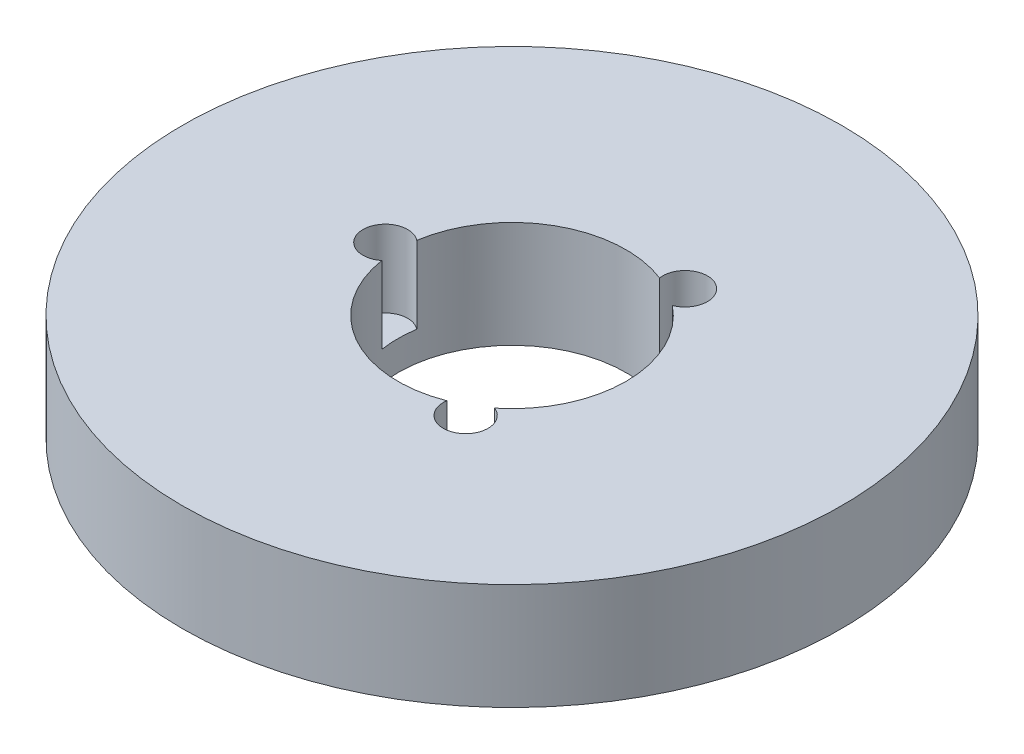
ISO-10303-21;
HEADER;
FILE_DESCRIPTION(('STEP AP214'),'2;1');
FILE_NAME('part.step','',(''),(''),'','','');
FILE_SCHEMA(('AUTOMOTIVE_DESIGN { 1 0 10303 214 1 1 1 1 }'));
ENDSEC;
DATA;
#1=APPLICATION_CONTEXT('core data for automotive mechanical design processes');
#2=APPLICATION_PROTOCOL_DEFINITION('international standard','automotive_design',2000,#1);
#3=PRODUCT_CONTEXT('',#1,'mechanical');
#4=PRODUCT('Part','Part','',(#3));
#5=PRODUCT_RELATED_PRODUCT_CATEGORY('part','',(#4));
#6=PRODUCT_DEFINITION_FORMATION('','',#4);
#7=PRODUCT_DEFINITION_CONTEXT('part definition',#1,'design');
#8=PRODUCT_DEFINITION('design','',#6,#7);
#9=PRODUCT_DEFINITION_SHAPE('','',#8);
#10=(LENGTH_UNIT() NAMED_UNIT(*) SI_UNIT(.MILLI.,.METRE.));
#11=(NAMED_UNIT(*) PLANE_ANGLE_UNIT() SI_UNIT($,.RADIAN.));
#12=(NAMED_UNIT(*) SI_UNIT($,.STERADIAN.) SOLID_ANGLE_UNIT());
#13=UNCERTAINTY_MEASURE_WITH_UNIT(LENGTH_MEASURE(1.E-05),#10,'distance_accuracy_value','');
#14=(GEOMETRIC_REPRESENTATION_CONTEXT(3) GLOBAL_UNCERTAINTY_ASSIGNED_CONTEXT((#13)) GLOBAL_UNIT_ASSIGNED_CONTEXT((#10,
#11,#12)) REPRESENTATION_CONTEXT('',''));
#15=CARTESIAN_POINT('',(0.,0.,0.));
#16=DIRECTION('',(0.,0.,1.));
#17=DIRECTION('',(1.,0.,0.));
#18=AXIS2_PLACEMENT_3D('',#15,#16,#17);
#19=CARTESIAN_POINT('',(0.,21.,0.));
#20=DIRECTION('',(0.,-1.,0.));
#21=DIRECTION('',(0.,0.,-1.));
#22=AXIS2_PLACEMENT_3D('',#19,#20,#21);
#23=CYLINDRICAL_SURFACE('',#22,65.);
#24=CARTESIAN_POINT('',(0.,21.,0.));
#25=DIRECTION('',(0.,1.,0.));
#26=DIRECTION('',(0.,0.,1.));
#27=AXIS2_PLACEMENT_3D('',#24,#25,#26);
#28=CIRCLE('',#27,65.);
#29=CARTESIAN_POINT('',(0.,21.,-65.));
#30=VERTEX_POINT('',#29);
#31=EDGE_CURVE('E126',#30,#30,#28,.T.);
#32=CARTESIAN_POINT('',(0.,0.,0.));
#33=DIRECTION('',(0.,1.,0.));
#34=DIRECTION('',(0.,0.,1.));
#35=AXIS2_PLACEMENT_3D('',#32,#33,#34);
#36=CIRCLE('',#35,65.);
#37=CARTESIAN_POINT('',(0.,0.,-65.));
#38=VERTEX_POINT('',#37);
#39=EDGE_CURVE('E124',#38,#38,#36,.T.);
#40=CARTESIAN_POINT('',(0.,21.,-65.));
#41=CARTESIAN_POINT('',(0.,20.78125,-65.));
#42=CARTESIAN_POINT('',(0.,20.5625,-65.));
#43=CARTESIAN_POINT('',(0.,20.125,-65.));
#44=CARTESIAN_POINT('',(0.,19.90625,-65.));
#45=CARTESIAN_POINT('',(0.,19.46875,-65.));
#46=CARTESIAN_POINT('',(0.,19.25,-65.));
#47=CARTESIAN_POINT('',(0.,18.8125,-65.));
#48=CARTESIAN_POINT('',(0.,18.59375,-65.));
#49=CARTESIAN_POINT('',(0.,18.15625,-65.));
#50=CARTESIAN_POINT('',(0.,17.9375,-65.));
#51=CARTESIAN_POINT('',(0.,17.5,-65.));
#52=CARTESIAN_POINT('',(0.,17.28125,-65.));
#53=CARTESIAN_POINT('',(0.,16.84375,-65.));
#54=CARTESIAN_POINT('',(0.,16.625,-65.));
#55=CARTESIAN_POINT('',(0.,16.1875,-65.));
#56=CARTESIAN_POINT('',(0.,15.96875,-65.));
#57=CARTESIAN_POINT('',(0.,15.53125,-65.));
#58=CARTESIAN_POINT('',(0.,15.3125,-65.));
#59=CARTESIAN_POINT('',(0.,14.875,-65.));
#60=CARTESIAN_POINT('',(0.,14.65625,-65.));
#61=CARTESIAN_POINT('',(0.,14.21875,-65.));
#62=CARTESIAN_POINT('',(0.,14.,-65.));
#63=CARTESIAN_POINT('',(0.,13.5625,-65.));
#64=CARTESIAN_POINT('',(0.,13.34375,-65.));
#65=CARTESIAN_POINT('',(0.,12.90625,-65.));
#66=CARTESIAN_POINT('',(0.,12.6875,-65.));
#67=CARTESIAN_POINT('',(0.,12.25,-65.));
#68=CARTESIAN_POINT('',(0.,12.03125,-65.));
#69=CARTESIAN_POINT('',(0.,11.59375,-65.));
#70=CARTESIAN_POINT('',(0.,11.375,-65.));
#71=CARTESIAN_POINT('',(0.,10.9375,-65.));
#72=CARTESIAN_POINT('',(0.,10.71875,-65.));
#73=CARTESIAN_POINT('',(0.,10.28125,-65.));
#74=CARTESIAN_POINT('',(0.,10.0625,-65.));
#75=CARTESIAN_POINT('',(0.,9.625,-65.));
#76=CARTESIAN_POINT('',(0.,9.40625,-65.));
#77=CARTESIAN_POINT('',(0.,8.96875,-65.));
#78=CARTESIAN_POINT('',(0.,8.75,-65.));
#79=CARTESIAN_POINT('',(0.,8.3125,-65.));
#80=CARTESIAN_POINT('',(0.,8.09375,-65.));
#81=CARTESIAN_POINT('',(0.,7.65625,-65.));
#82=CARTESIAN_POINT('',(0.,7.4375,-65.));
#83=CARTESIAN_POINT('',(0.,7.,-65.));
#84=CARTESIAN_POINT('',(0.,6.78125,-65.));
#85=CARTESIAN_POINT('',(0.,6.34375,-65.));
#86=CARTESIAN_POINT('',(0.,6.125,-65.));
#87=CARTESIAN_POINT('',(0.,5.6875,-65.));
#88=CARTESIAN_POINT('',(0.,5.46875,-65.));
#89=CARTESIAN_POINT('',(0.,5.03125,-65.));
#90=CARTESIAN_POINT('',(0.,4.8125,-65.));
#91=CARTESIAN_POINT('',(0.,4.375,-65.));
#92=CARTESIAN_POINT('',(0.,4.15625,-65.));
#93=CARTESIAN_POINT('',(0.,3.71875,-65.));
#94=CARTESIAN_POINT('',(0.,3.5,-65.));
#95=CARTESIAN_POINT('',(0.,3.0625,-65.));
#96=CARTESIAN_POINT('',(0.,2.84375,-65.));
#97=CARTESIAN_POINT('',(0.,2.40625,-65.));
#98=CARTESIAN_POINT('',(0.,2.1875,-65.));
#99=CARTESIAN_POINT('',(0.,1.75,-65.));
#100=CARTESIAN_POINT('',(0.,1.53125,-65.));
#101=CARTESIAN_POINT('',(0.,1.09375,-65.));
#102=CARTESIAN_POINT('',(0.,0.875000000000001,-65.));
#103=CARTESIAN_POINT('',(0.,0.4375,-65.));
#104=CARTESIAN_POINT('',(0.,0.21875,-65.));
#105=CARTESIAN_POINT('',(0.,0.,-65.));
#106=B_SPLINE_CURVE_WITH_KNOTS('',3,(#40,#41,#42,#43,#44,#45,#46,#47,#48,#49,#50,#51,#52,#53,
#54,#55,#56,#57,#58,#59,#60,#61,#62,#63,#64,#65,#66,#67,#68,#69,#70,#71,#72,#73,#74,#75,#76,#77,
#78,#79,#80,#81,#82,#83,#84,#85,#86,#87,#88,#89,#90,#91,#92,#93,#94,#95,#96,#97,#98,#99,#100,
#101,#102,#103,#104,#105),.UNSPECIFIED.,.F.,.F.,(4,2,2,2,2,2,2,2,2,2,2,2,2,2,2,2,2,2,2,2,2,2,2,
2,2,2,2,2,2,2,2,2,4),(0.,0.656249999999997,1.3125,1.96875,2.625,3.28125,3.9375,4.59375,5.25,
5.90625,6.5625,7.21875,7.875,8.53125,9.1875,9.84375,10.5,11.15625,11.8125,12.46875,13.125,
13.78125,14.4375,15.09375,15.75,16.40625,17.0625,17.71875,18.375,19.03125,19.6875,20.34375,21.),.UNSPECIFIED.);
#107=EDGE_CURVE('BSEAM39',#30,#38,#106,.T.);
#108=ORIENTED_EDGE('',*,*,#31,.F.);
#109=ORIENTED_EDGE('',*,*,#39,.T.);
#110=ORIENTED_EDGE('',*,*,#107,.T.);
#111=ORIENTED_EDGE('',*,*,#107,.F.);
#112=EDGE_LOOP('',(#108,#110,#109,#111));
#113=FACE_BOUND('',#112,.T.);
#114=ADVANCED_FACE('F39',(#113),#23,.T.);
#115=CARTESIAN_POINT('',(0.,21.,0.));
#116=DIRECTION('',(0.,1.,0.));
#117=DIRECTION('',(0.,0.,1.));
#118=AXIS2_PLACEMENT_3D('',#115,#116,#117);
#119=PLANE('',#118);
#120=CARTESIAN_POINT('',(12.4921964481098,21.,21.6371189462574));
#121=DIRECTION('',(0.,1.,0.));
#122=DIRECTION('',(0.866025403784436,0.,-0.500000000000004));
#123=AXIS2_PLACEMENT_3D('',#120,#121,#122);
#124=CIRCLE('',#123,4.41411423687953);
#125=CARTESIAN_POINT('',(8.1271268471688,21.,20.9809391879875));
#126=VERTEX_POINT('',#125);
#127=CARTESIAN_POINT('',(14.1064629084694,21.,17.5287679034203));
#128=VERTEX_POINT('',#127);
#129=EDGE_CURVE('E147',#126,#128,#124,.T.);
#130=ORIENTED_EDGE('',*,*,#129,.F.);
#131=CARTESIAN_POINT('',(0.,21.,0.));
#132=DIRECTION('',(0.,1.,0.));
#133=DIRECTION('',(0.,0.,1.));
#134=AXIS2_PLACEMENT_3D('',#131,#132,#133);
#135=CIRCLE('',#134,22.5);
#136=CARTESIAN_POINT('',(-22.233589755638,21.,3.45217128456713));
#137=VERTEX_POINT('',#136);
#138=EDGE_CURVE('E118',#137,#126,#135,.T.);
#139=ORIENTED_EDGE('',*,*,#138,.F.);
#140=CARTESIAN_POINT('',(-24.9843928962194,21.,0.));
#141=DIRECTION('',(0.,1.,0.));
#142=DIRECTION('',(0.,0.,1.));
#143=AXIS2_PLACEMENT_3D('',#140,#141,#142);
#144=CIRCLE('',#143,4.41411423687953);
#145=CARTESIAN_POINT('',(-22.233589755638,21.,-3.45217128456713));
#146=VERTEX_POINT('',#145);
#147=EDGE_CURVE('E113',#146,#137,#144,.T.);
#148=ORIENTED_EDGE('',*,*,#147,.F.);
#149=CARTESIAN_POINT('',(8.1271268471685,21.,-20.9809391879876));
#150=VERTEX_POINT('',#149);
#151=EDGE_CURVE('E106',#150,#146,#135,.T.);
#152=ORIENTED_EDGE('',*,*,#151,.F.);
#153=CARTESIAN_POINT('',(12.4921964481095,21.,-21.6371189462576));
#154=DIRECTION('',(0.,1.,0.));
#155=DIRECTION('',(-0.866025403784443,0.,-0.499999999999992));
#156=AXIS2_PLACEMENT_3D('',#153,#154,#155);
#157=CIRCLE('',#156,4.41411423687953);
#158=CARTESIAN_POINT('',(14.1064629084691,21.,-17.5287679034205));
#159=VERTEX_POINT('',#158);
#160=EDGE_CURVE('E90',#159,#150,#157,.T.);
#161=ORIENTED_EDGE('',*,*,#160,.F.);
#162=EDGE_CURVE('E116',#128,#159,#135,.T.);
#163=ORIENTED_EDGE('',*,*,#162,.F.);
#164=EDGE_LOOP('',(#130,#139,#148,#152,#161,#163));
#165=FACE_BOUND('',#164,.T.);
#166=ORIENTED_EDGE('',*,*,#31,.T.);
#167=EDGE_LOOP('',(#166));
#168=FACE_BOUND('',#167,.T.);
#169=ADVANCED_FACE('F115',(#165,#168),#119,.T.);
#170=CARTESIAN_POINT('',(0.,0.,0.));
#171=DIRECTION('',(0.,1.,0.));
#172=DIRECTION('',(0.,0.,1.));
#173=AXIS2_PLACEMENT_3D('',#170,#171,#172);
#174=PLANE('',#173);
#175=CARTESIAN_POINT('',(0.,0.,0.));
#176=DIRECTION('',(0.,1.,0.));
#177=DIRECTION('',(0.,0.,1.));
#178=AXIS2_PLACEMENT_3D('',#175,#176,#177);
#179=CIRCLE('',#178,22.5);
#180=CARTESIAN_POINT('',(0.,0.,22.5));
#181=VERTEX_POINT('',#180);
#182=EDGE_CURVE('E120',#181,#181,#179,.T.);
#183=ORIENTED_EDGE('',*,*,#182,.T.);
#184=EDGE_LOOP('',(#183));
#185=FACE_BOUND('',#184,.T.);
#186=ORIENTED_EDGE('',*,*,#39,.F.);
#187=EDGE_LOOP('',(#186));
#188=FACE_BOUND('',#187,.T.);
#189=ADVANCED_FACE('F164',(#185,#188),#174,.F.);
#190=CARTESIAN_POINT('',(0.,21.,0.));
#191=DIRECTION('',(0.,-1.,0.));
#192=DIRECTION('',(0.,0.,-1.));
#193=AXIS2_PLACEMENT_3D('',#190,#191,#192);
#194=CYLINDRICAL_SURFACE('',#193,22.5);
#195=DIRECTION('',(0.,1.,0.));
#196=VECTOR('',#195,1.);
#197=CARTESIAN_POINT('',(8.1271268471688,13.4108951795975,20.9809391879875));
#198=LINE('',#197,#196);
#199=CARTESIAN_POINT('',(8.1271268471688,5.82179035919507,20.9809391879875));
#200=VERTEX_POINT('',#199);
#201=EDGE_CURVE('E11',#200,#126,#198,.T.);
#202=ORIENTED_EDGE('',*,*,#201,.F.);
#203=CARTESIAN_POINT('',(0.,5.82179035919507,0.));
#204=DIRECTION('',(0.,1.,0.));
#205=DIRECTION('',(0.,0.,1.));
#206=AXIS2_PLACEMENT_3D('',#203,#204,#205);
#207=CIRCLE('',#206,22.5);
#208=CARTESIAN_POINT('',(14.1064629084694,5.82179035919507,17.5287679034203));
#209=VERTEX_POINT('',#208);
#210=EDGE_CURVE('E144',#200,#209,#207,.T.);
#211=ORIENTED_EDGE('',*,*,#210,.T.);
#212=DIRECTION('',(0.,1.,0.));
#213=VECTOR('',#212,1.);
#214=CARTESIAN_POINT('',(14.1064629084694,13.4108951795975,17.5287679034203));
#215=LINE('',#214,#213);
#216=EDGE_CURVE('E46',#128,#209,#215,.F.);
#217=ORIENTED_EDGE('',*,*,#216,.F.);
#218=ORIENTED_EDGE('',*,*,#162,.T.);
#219=DIRECTION('',(0.,1.,0.));
#220=VECTOR('',#219,1.);
#221=CARTESIAN_POINT('',(14.1064629084691,13.4108951795975,-17.5287679034205));
#222=LINE('',#221,#220);
#223=CARTESIAN_POINT('',(14.1064629084691,5.82179035919507,-17.5287679034205));
#224=VERTEX_POINT('',#223);
#225=EDGE_CURVE('E92',#224,#159,#222,.T.);
#226=ORIENTED_EDGE('',*,*,#225,.F.);
#227=CARTESIAN_POINT('',(0.,5.82179035919507,0.));
#228=DIRECTION('',(0.,1.,0.));
#229=DIRECTION('',(0.,0.,1.));
#230=AXIS2_PLACEMENT_3D('',#227,#228,#229);
#231=CIRCLE('',#230,22.5);
#232=CARTESIAN_POINT('',(8.1271268471685,5.82179035919507,-20.9809391879876));
#233=VERTEX_POINT('',#232);
#234=EDGE_CURVE('E107',#224,#233,#231,.T.);
#235=ORIENTED_EDGE('',*,*,#234,.T.);
#236=DIRECTION('',(0.,1.,0.));
#237=VECTOR('',#236,1.);
#238=CARTESIAN_POINT('',(8.1271268471685,13.4108951795975,-20.9809391879876));
#239=LINE('',#238,#237);
#240=EDGE_CURVE('E95',#150,#233,#239,.F.);
#241=ORIENTED_EDGE('',*,*,#240,.F.);
#242=ORIENTED_EDGE('',*,*,#151,.T.);
#243=DIRECTION('',(0.,1.,0.));
#244=VECTOR('',#243,1.);
#245=CARTESIAN_POINT('',(-22.233589755638,13.4108951795975,-3.45217128456713));
#246=LINE('',#245,#244);
#247=CARTESIAN_POINT('',(-22.233589755638,5.82179035919507,-3.45217128456713));
#248=VERTEX_POINT('',#247);
#249=EDGE_CURVE('E143',#248,#146,#246,.T.);
#250=ORIENTED_EDGE('',*,*,#249,.F.);
#251=CARTESIAN_POINT('',(0.,5.82179035919507,0.));
#252=DIRECTION('',(0.,1.,0.));
#253=DIRECTION('',(0.,0.,1.));
#254=AXIS2_PLACEMENT_3D('',#251,#252,#253);
#255=CIRCLE('',#254,22.5);
#256=CARTESIAN_POINT('',(-22.233589755638,5.82179035919507,3.45217128456713));
#257=VERTEX_POINT('',#256);
#258=EDGE_CURVE('E132',#248,#257,#255,.T.);
#259=ORIENTED_EDGE('',*,*,#258,.T.);
#260=DIRECTION('',(0.,1.,0.));
#261=VECTOR('',#260,1.);
#262=CARTESIAN_POINT('',(-22.233589755638,13.4108951795975,3.45217128456713));
#263=LINE('',#262,#261);
#264=EDGE_CURVE('E137',#137,#257,#263,.F.);
#265=ORIENTED_EDGE('',*,*,#264,.F.);
#266=ORIENTED_EDGE('',*,*,#138,.T.);
#267=EDGE_LOOP('',(#202,#211,#217,#218,#226,#235,#241,#242,#250,#259,#265,#266));
#268=FACE_BOUND('',#267,.T.);
#269=ORIENTED_EDGE('',*,*,#182,.F.);
#270=EDGE_LOOP('',(#269));
#271=FACE_BOUND('',#270,.T.);
#272=ADVANCED_FACE('F103',(#268,#271),#194,.F.);
#273=CARTESIAN_POINT('',(-24.9843928962194,5.82179035919507,0.));
#274=DIRECTION('',(0.,1.,0.));
#275=DIRECTION('',(0.,0.,1.));
#276=AXIS2_PLACEMENT_3D('',#273,#274,#275);
#277=CYLINDRICAL_SURFACE('',#276,4.41411423687953);
#278=ORIENTED_EDGE('',*,*,#249,.T.);
#279=ORIENTED_EDGE('',*,*,#147,.T.);
#280=ORIENTED_EDGE('',*,*,#264,.T.);
#281=CARTESIAN_POINT('',(-24.9843928962194,5.82179035919507,0.));
#282=DIRECTION('',(0.,1.,0.));
#283=DIRECTION('',(0.,0.,1.));
#284=AXIS2_PLACEMENT_3D('',#281,#282,#283);
#285=CIRCLE('',#284,4.41411423687953);
#286=EDGE_CURVE('E121',#248,#257,#285,.T.);
#287=ORIENTED_EDGE('',*,*,#286,.F.);
#288=EDGE_LOOP('',(#278,#279,#280,#287));
#289=FACE_BOUND('',#288,.T.);
#290=ADVANCED_FACE('F174',(#289),#277,.F.);
#291=CARTESIAN_POINT('',(-24.9843928962194,5.82179035919507,0.));
#292=DIRECTION('',(0.,1.,0.));
#293=DIRECTION('',(0.,0.,1.));
#294=AXIS2_PLACEMENT_3D('',#291,#292,#293);
#295=PLANE('',#294);
#296=ORIENTED_EDGE('',*,*,#286,.T.);
#297=ORIENTED_EDGE('',*,*,#258,.F.);
#298=EDGE_LOOP('',(#296,#297));
#299=FACE_BOUND('',#298,.T.);
#300=ADVANCED_FACE('F177',(#299),#295,.T.);
#301=CARTESIAN_POINT('',(12.4921964481095,5.82179035919507,-21.6371189462576));
#302=DIRECTION('',(0.,1.,0.));
#303=DIRECTION('',(0.,0.,1.));
#304=AXIS2_PLACEMENT_3D('',#301,#302,#303);
#305=CYLINDRICAL_SURFACE('',#304,4.41411423687953);
#306=ORIENTED_EDGE('',*,*,#225,.T.);
#307=ORIENTED_EDGE('',*,*,#160,.T.);
#308=ORIENTED_EDGE('',*,*,#240,.T.);
#309=CARTESIAN_POINT('',(12.4921964481095,5.82179035919507,-21.6371189462576));
#310=DIRECTION('',(0.,1.,0.));
#311=DIRECTION('',(-0.866025403784443,0.,-0.499999999999992));
#312=AXIS2_PLACEMENT_3D('',#309,#310,#311);
#313=CIRCLE('',#312,4.41411423687953);
#314=EDGE_CURVE('E56',#224,#233,#313,.T.);
#315=ORIENTED_EDGE('',*,*,#314,.F.);
#316=EDGE_LOOP('',(#306,#307,#308,#315));
#317=FACE_BOUND('',#316,.T.);
#318=ADVANCED_FACE('F93',(#317),#305,.F.);
#319=CARTESIAN_POINT('',(12.4921964481095,5.82179035919507,-21.6371189462576));
#320=DIRECTION('',(0.,1.,0.));
#321=DIRECTION('',(-0.866025403784443,0.,-0.499999999999992));
#322=AXIS2_PLACEMENT_3D('',#319,#320,#321);
#323=PLANE('',#322);
#324=ORIENTED_EDGE('',*,*,#314,.T.);
#325=ORIENTED_EDGE('',*,*,#234,.F.);
#326=EDGE_LOOP('',(#324,#325));
#327=FACE_BOUND('',#326,.T.);
#328=ADVANCED_FACE('F160',(#327),#323,.T.);
#329=CARTESIAN_POINT('',(12.4921964481098,5.82179035919507,21.6371189462574));
#330=DIRECTION('',(0.,1.,0.));
#331=DIRECTION('',(0.,0.,1.));
#332=AXIS2_PLACEMENT_3D('',#329,#330,#331);
#333=CYLINDRICAL_SURFACE('',#332,4.41411423687953);
#334=ORIENTED_EDGE('',*,*,#201,.T.);
#335=ORIENTED_EDGE('',*,*,#129,.T.);
#336=ORIENTED_EDGE('',*,*,#216,.T.);
#337=CARTESIAN_POINT('',(12.4921964481098,5.82179035919507,21.6371189462574));
#338=DIRECTION('',(0.,1.,0.));
#339=DIRECTION('',(0.866025403784436,0.,-0.500000000000004));
#340=AXIS2_PLACEMENT_3D('',#337,#338,#339);
#341=CIRCLE('',#340,4.41411423687953);
#342=EDGE_CURVE('E55',#200,#209,#341,.T.);
#343=ORIENTED_EDGE('',*,*,#342,.F.);
#344=EDGE_LOOP('',(#334,#335,#336,#343));
#345=FACE_BOUND('',#344,.T.);
#346=ADVANCED_FACE('F149',(#345),#333,.F.);
#347=CARTESIAN_POINT('',(12.4921964481098,5.82179035919507,21.6371189462574));
#348=DIRECTION('',(0.,1.,0.));
#349=DIRECTION('',(0.866025403784436,0.,-0.500000000000004));
#350=AXIS2_PLACEMENT_3D('',#347,#348,#349);
#351=PLANE('',#350);
#352=ORIENTED_EDGE('',*,*,#342,.T.);
#353=ORIENTED_EDGE('',*,*,#210,.F.);
#354=EDGE_LOOP('',(#352,#353));
#355=FACE_BOUND('',#354,.T.);
#356=ADVANCED_FACE('F151',(#355),#351,.T.);
#357=CLOSED_SHELL('',(#114,#169,#189,#272,#290,#300,#318,#328,#346,#356));
#358=MANIFOLD_SOLID_BREP('B2',#357);
#359=ADVANCED_BREP_SHAPE_REPRESENTATION('',(#18,#358),#14);
#360=SHAPE_DEFINITION_REPRESENTATION(#9,#359);
ENDSEC;
END-ISO-10303-21;
